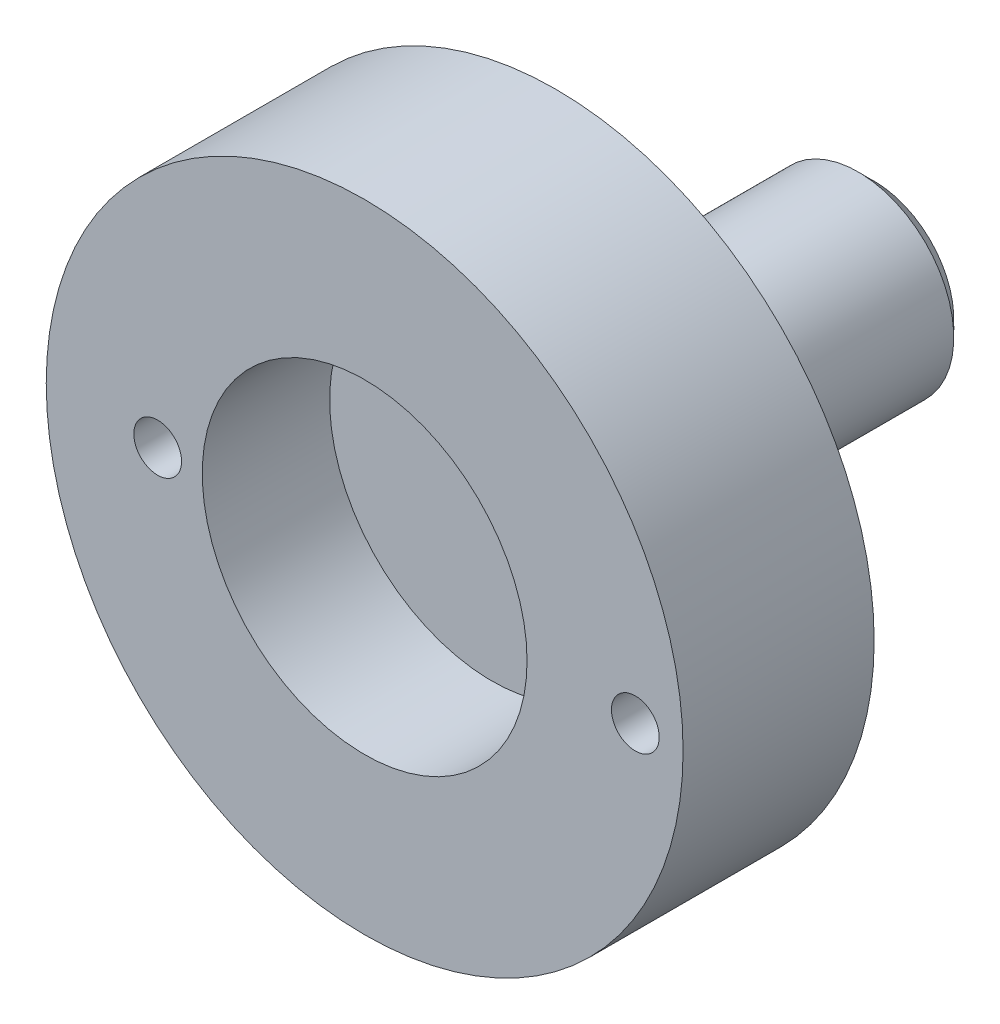
ISO-10303-21;
HEADER;
FILE_DESCRIPTION(('STEP AP214'),'2;1');
FILE_NAME('part.step','',(''),(''),'','','');
FILE_SCHEMA(('AUTOMOTIVE_DESIGN { 1 0 10303 214 1 1 1 1 }'));
ENDSEC;
DATA;
#1=APPLICATION_CONTEXT('core data for automotive mechanical design processes');
#2=APPLICATION_PROTOCOL_DEFINITION('international standard','automotive_design',2000,#1);
#3=PRODUCT_CONTEXT('',#1,'mechanical');
#4=PRODUCT('Part','Part','',(#3));
#5=PRODUCT_RELATED_PRODUCT_CATEGORY('part','',(#4));
#6=PRODUCT_DEFINITION_FORMATION('','',#4);
#7=PRODUCT_DEFINITION_CONTEXT('part definition',#1,'design');
#8=PRODUCT_DEFINITION('design','',#6,#7);
#9=PRODUCT_DEFINITION_SHAPE('','',#8);
#10=(LENGTH_UNIT() NAMED_UNIT(*) SI_UNIT(.MILLI.,.METRE.));
#11=(NAMED_UNIT(*) PLANE_ANGLE_UNIT() SI_UNIT($,.RADIAN.));
#12=(NAMED_UNIT(*) SI_UNIT($,.STERADIAN.) SOLID_ANGLE_UNIT());
#13=UNCERTAINTY_MEASURE_WITH_UNIT(LENGTH_MEASURE(1.E-05),#10,'distance_accuracy_value','');
#14=(GEOMETRIC_REPRESENTATION_CONTEXT(3) GLOBAL_UNCERTAINTY_ASSIGNED_CONTEXT((#13)) GLOBAL_UNIT_ASSIGNED_CONTEXT((#10,
#11,#12)) REPRESENTATION_CONTEXT('',''));
#15=CARTESIAN_POINT('',(0.,0.,0.));
#16=DIRECTION('',(0.,0.,1.));
#17=DIRECTION('',(1.,0.,0.));
#18=AXIS2_PLACEMENT_3D('',#15,#16,#17);
#19=CARTESIAN_POINT('',(0.,0.,4.));
#20=DIRECTION('',(0.,0.,1.));
#21=DIRECTION('',(1.,0.,0.));
#22=AXIS2_PLACEMENT_3D('',#19,#20,#21);
#23=PLANE('',#22);
#24=CARTESIAN_POINT('',(8.5,0.,4.));
#25=DIRECTION('',(0.,0.,1.));
#26=DIRECTION('',(1.,0.,0.));
#27=AXIS2_PLACEMENT_3D('',#24,#25,#26);
#28=CIRCLE('',#27,0.75);
#29=CARTESIAN_POINT('',(9.25,0.,4.));
#30=VERTEX_POINT('',#29);
#31=EDGE_CURVE('E73',#30,#30,#28,.F.);
#32=ORIENTED_EDGE('',*,*,#31,.T.);
#33=EDGE_LOOP('',(#32));
#34=FACE_BOUND('',#33,.T.);
#35=CARTESIAN_POINT('',(-6.5,0.,4.));
#36=DIRECTION('',(0.,0.,1.));
#37=DIRECTION('',(1.,0.,0.));
#38=AXIS2_PLACEMENT_3D('',#35,#36,#37);
#39=CIRCLE('',#38,0.75);
#40=CARTESIAN_POINT('',(-5.75,0.,4.));
#41=VERTEX_POINT('',#40);
#42=EDGE_CURVE('E67',#41,#41,#39,.F.);
#43=ORIENTED_EDGE('',*,*,#42,.T.);
#44=EDGE_LOOP('',(#43));
#45=FACE_BOUND('',#44,.T.);
#46=CARTESIAN_POINT('',(0.,0.,4.));
#47=DIRECTION('',(0.,0.,1.));
#48=DIRECTION('',(1.,0.,0.));
#49=AXIS2_PLACEMENT_3D('',#46,#47,#48);
#50=CIRCLE('',#49,10.);
#51=CARTESIAN_POINT('',(10.,0.,4.));
#52=VERTEX_POINT('',#51);
#53=EDGE_CURVE('E54',#52,#52,#50,.T.);
#54=ORIENTED_EDGE('',*,*,#53,.T.);
#55=EDGE_LOOP('',(#54));
#56=FACE_BOUND('',#55,.T.);
#57=CARTESIAN_POINT('',(0.,0.,4.));
#58=DIRECTION('',(0.,0.,1.));
#59=DIRECTION('',(1.,0.,0.));
#60=AXIS2_PLACEMENT_3D('',#57,#58,#59);
#61=CIRCLE('',#60,5.1);
#62=CARTESIAN_POINT('',(5.1,0.,4.));
#63=VERTEX_POINT('',#62);
#64=EDGE_CURVE('E57',#63,#63,#61,.T.);
#65=ORIENTED_EDGE('',*,*,#64,.F.);
#66=EDGE_LOOP('',(#65));
#67=FACE_BOUND('',#66,.T.);
#68=ADVANCED_FACE('F33',(#34,#45,#56,#67),#23,.T.);
#69=CARTESIAN_POINT('',(0.,0.,4.));
#70=DIRECTION('',(0.,0.,-1.));
#71=DIRECTION('',(-1.,0.,0.));
#72=AXIS2_PLACEMENT_3D('',#69,#70,#71);
#73=CYLINDRICAL_SURFACE('',#72,10.);
#74=ORIENTED_EDGE('',*,*,#53,.F.);
#75=EDGE_LOOP('',(#74));
#76=FACE_BOUND('',#75,.T.);
#77=CARTESIAN_POINT('',(0.,0.,-2.));
#78=DIRECTION('',(0.,0.,-1.));
#79=DIRECTION('',(-1.,0.,0.));
#80=AXIS2_PLACEMENT_3D('',#77,#78,#79);
#81=CIRCLE('',#80,10.);
#82=CARTESIAN_POINT('',(-10.,0.,-2.));
#83=VERTEX_POINT('',#82);
#84=EDGE_CURVE('E61',#83,#83,#81,.T.);
#85=ORIENTED_EDGE('',*,*,#84,.F.);
#86=EDGE_LOOP('',(#85));
#87=FACE_BOUND('',#86,.T.);
#88=ADVANCED_FACE('F93',(#76,#87),#73,.T.);
#89=CARTESIAN_POINT('',(0.,0.,4.));
#90=DIRECTION('',(0.,0.,-1.));
#91=DIRECTION('',(-1.,0.,0.));
#92=AXIS2_PLACEMENT_3D('',#89,#90,#91);
#93=CYLINDRICAL_SURFACE('',#92,5.1);
#94=ORIENTED_EDGE('',*,*,#64,.T.);
#95=EDGE_LOOP('',(#94));
#96=FACE_BOUND('',#95,.T.);
#97=CARTESIAN_POINT('',(0.,0.,0.));
#98=DIRECTION('',(0.,0.,1.));
#99=DIRECTION('',(1.,0.,0.));
#100=AXIS2_PLACEMENT_3D('',#97,#98,#99);
#101=CIRCLE('',#100,5.1);
#102=CARTESIAN_POINT('',(5.1,0.,0.));
#103=VERTEX_POINT('',#102);
#104=EDGE_CURVE('E58',#103,#103,#101,.T.);
#105=ORIENTED_EDGE('',*,*,#104,.F.);
#106=EDGE_LOOP('',(#105));
#107=FACE_BOUND('',#106,.T.);
#108=ADVANCED_FACE('F95',(#96,#107),#93,.F.);
#109=CARTESIAN_POINT('',(0.,0.,0.));
#110=DIRECTION('',(0.,0.,-1.));
#111=DIRECTION('',(-1.,0.,0.));
#112=AXIS2_PLACEMENT_3D('',#109,#110,#111);
#113=PLANE('',#112);
#114=ORIENTED_EDGE('',*,*,#104,.T.);
#115=EDGE_LOOP('',(#114));
#116=FACE_BOUND('',#115,.T.);
#117=ADVANCED_FACE('F85',(#116),#113,.F.);
#118=CARTESIAN_POINT('',(0.,0.,-2.));
#119=DIRECTION('',(0.,0.,-1.));
#120=DIRECTION('',(-1.,0.,0.));
#121=AXIS2_PLACEMENT_3D('',#118,#119,#120);
#122=PLANE('',#121);
#123=CARTESIAN_POINT('',(8.5,0.,-2.));
#124=DIRECTION('',(0.,0.,-1.));
#125=DIRECTION('',(-1.,0.,0.));
#126=AXIS2_PLACEMENT_3D('',#123,#124,#125);
#127=CIRCLE('',#126,0.75);
#128=CARTESIAN_POINT('',(7.75,0.,-2.));
#129=VERTEX_POINT('',#128);
#130=EDGE_CURVE('E66',#129,#129,#127,.T.);
#131=ORIENTED_EDGE('',*,*,#130,.F.);
#132=EDGE_LOOP('',(#131));
#133=FACE_BOUND('',#132,.T.);
#134=CARTESIAN_POINT('',(-6.5,0.,-2.));
#135=DIRECTION('',(0.,0.,-1.));
#136=DIRECTION('',(-1.,0.,0.));
#137=AXIS2_PLACEMENT_3D('',#134,#135,#136);
#138=CIRCLE('',#137,0.75);
#139=CARTESIAN_POINT('',(-7.25,0.,-2.));
#140=VERTEX_POINT('',#139);
#141=EDGE_CURVE('E70',#140,#140,#138,.T.);
#142=ORIENTED_EDGE('',*,*,#141,.F.);
#143=EDGE_LOOP('',(#142));
#144=FACE_BOUND('',#143,.T.);
#145=CARTESIAN_POINT('',(0.,0.,-2.));
#146=DIRECTION('',(0.,0.,-1.));
#147=DIRECTION('',(-1.,0.,0.));
#148=AXIS2_PLACEMENT_3D('',#145,#146,#147);
#149=CIRCLE('',#148,4.);
#150=CARTESIAN_POINT('',(-4.,0.,-2.));
#151=VERTEX_POINT('',#150);
#152=EDGE_CURVE('E45',#151,#151,#149,.F.);
#153=ORIENTED_EDGE('',*,*,#152,.T.);
#154=EDGE_LOOP('',(#153));
#155=FACE_BOUND('',#154,.T.);
#156=ORIENTED_EDGE('',*,*,#84,.T.);
#157=EDGE_LOOP('',(#156));
#158=FACE_BOUND('',#157,.T.);
#159=ADVANCED_FACE('F81',(#133,#144,#155,#158),#122,.T.);
#160=CARTESIAN_POINT('',(0.,0.,-12.));
#161=DIRECTION('',(0.,0.,1.));
#162=DIRECTION('',(1.,0.,0.));
#163=AXIS2_PLACEMENT_3D('',#160,#161,#162);
#164=CYLINDRICAL_SURFACE('',#163,3.);
#165=CARTESIAN_POINT('',(0.,0.,-11.5));
#166=DIRECTION('',(0.,0.,-1.));
#167=DIRECTION('',(-1.,0.,0.));
#168=AXIS2_PLACEMENT_3D('',#165,#166,#167);
#169=CIRCLE('',#168,3.);
#170=CARTESIAN_POINT('',(-3.,0.,-11.5));
#171=VERTEX_POINT('',#170);
#172=EDGE_CURVE('E10',#171,#171,#169,.F.);
#173=ORIENTED_EDGE('',*,*,#172,.T.);
#174=EDGE_LOOP('',(#173));
#175=FACE_BOUND('',#174,.T.);
#176=CARTESIAN_POINT('',(0.,0.,-3.));
#177=DIRECTION('',(0.,0.,-1.));
#178=DIRECTION('',(-1.,0.,0.));
#179=AXIS2_PLACEMENT_3D('',#176,#177,#178);
#180=CIRCLE('',#179,3.);
#181=CARTESIAN_POINT('',(-3.,0.,-3.));
#182=VERTEX_POINT('',#181);
#183=EDGE_CURVE('E49',#182,#182,#180,.T.);
#184=ORIENTED_EDGE('',*,*,#183,.T.);
#185=EDGE_LOOP('',(#184));
#186=FACE_BOUND('',#185,.T.);
#187=ADVANCED_FACE('F84',(#175,#186),#164,.T.);
#188=CARTESIAN_POINT('',(0.,0.,-12.));
#189=DIRECTION('',(0.,0.,-1.));
#190=DIRECTION('',(-1.,0.,0.));
#191=AXIS2_PLACEMENT_3D('',#188,#189,#190);
#192=PLANE('',#191);
#193=CARTESIAN_POINT('',(0.,0.,-12.));
#194=DIRECTION('',(0.,0.,-1.));
#195=DIRECTION('',(-1.,0.,0.));
#196=AXIS2_PLACEMENT_3D('',#193,#194,#195);
#197=CIRCLE('',#196,2.5);
#198=CARTESIAN_POINT('',(-2.5,0.,-12.));
#199=VERTEX_POINT('',#198);
#200=EDGE_CURVE('E41',#199,#199,#197,.T.);
#201=ORIENTED_EDGE('',*,*,#200,.T.);
#202=EDGE_LOOP('',(#201));
#203=FACE_BOUND('',#202,.T.);
#204=ADVANCED_FACE('F112',(#203),#192,.T.);
#205=CARTESIAN_POINT('',(0.,0.,-3.));
#206=DIRECTION('',(0.,0.,1.));
#207=DIRECTION('',(1.,0.,0.));
#208=AXIS2_PLACEMENT_3D('',#205,#206,#207);
#209=CONICAL_SURFACE('',#208,3.,0.785398163397444);
#210=ORIENTED_EDGE('',*,*,#152,.F.);
#211=EDGE_LOOP('',(#210));
#212=FACE_BOUND('',#211,.T.);
#213=ORIENTED_EDGE('',*,*,#183,.F.);
#214=EDGE_LOOP('',(#213));
#215=FACE_BOUND('',#214,.T.);
#216=ADVANCED_FACE('F108',(#212,#215),#209,.T.);
#217=CARTESIAN_POINT('',(0.,0.,-12.));
#218=DIRECTION('',(0.,0.,1.));
#219=DIRECTION('',(1.,0.,0.));
#220=AXIS2_PLACEMENT_3D('',#217,#218,#219);
#221=CONICAL_SURFACE('',#220,2.5,0.785398163397444);
#222=ORIENTED_EDGE('',*,*,#172,.F.);
#223=EDGE_LOOP('',(#222));
#224=FACE_BOUND('',#223,.T.);
#225=ORIENTED_EDGE('',*,*,#200,.F.);
#226=EDGE_LOOP('',(#225));
#227=FACE_BOUND('',#226,.T.);
#228=ADVANCED_FACE('F36',(#224,#227),#221,.T.);
#229=CARTESIAN_POINT('',(-6.5,0.,4.001));
#230=DIRECTION('',(0.,0.,-1.));
#231=DIRECTION('',(-1.,0.,0.));
#232=AXIS2_PLACEMENT_3D('',#229,#230,#231);
#233=CYLINDRICAL_SURFACE('',#232,0.75);
#234=ORIENTED_EDGE('',*,*,#42,.F.);
#235=EDGE_LOOP('',(#234));
#236=FACE_BOUND('',#235,.T.);
#237=ORIENTED_EDGE('',*,*,#141,.T.);
#238=EDGE_LOOP('',(#237));
#239=FACE_BOUND('',#238,.T.);
#240=ADVANCED_FACE('F118',(#236,#239),#233,.F.);
#241=CARTESIAN_POINT('',(8.5,0.,4.001));
#242=DIRECTION('',(0.,0.,-1.));
#243=DIRECTION('',(-1.,0.,0.));
#244=AXIS2_PLACEMENT_3D('',#241,#242,#243);
#245=CYLINDRICAL_SURFACE('',#244,0.75);
#246=ORIENTED_EDGE('',*,*,#31,.F.);
#247=EDGE_LOOP('',(#246));
#248=FACE_BOUND('',#247,.T.);
#249=ORIENTED_EDGE('',*,*,#130,.T.);
#250=EDGE_LOOP('',(#249));
#251=FACE_BOUND('',#250,.T.);
#252=ADVANCED_FACE('F79',(#248,#251),#245,.F.);
#253=CLOSED_SHELL('',(#68,#88,#108,#117,#159,#187,#204,#216,#228,#240,#252));
#254=MANIFOLD_SOLID_BREP('B2',#253);
#255=ADVANCED_BREP_SHAPE_REPRESENTATION('',(#18,#254),#14);
#256=SHAPE_DEFINITION_REPRESENTATION(#9,#255);
ENDSEC;
END-ISO-10303-21;
